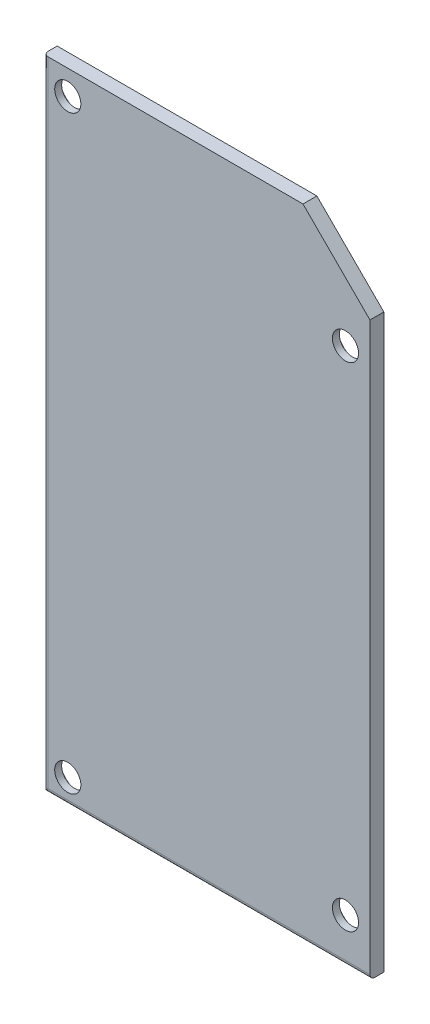
ISO-10303-21;
HEADER;
FILE_DESCRIPTION(('STEP AP214'),'2;1');
FILE_NAME('part.step','',(''),(''),'','','');
FILE_SCHEMA(('AUTOMOTIVE_DESIGN { 1 0 10303 214 1 1 1 1 }'));
ENDSEC;
DATA;
#1=APPLICATION_CONTEXT('core data for automotive mechanical design processes');
#2=APPLICATION_PROTOCOL_DEFINITION('international standard','automotive_design',2000,#1);
#3=PRODUCT_CONTEXT('',#1,'mechanical');
#4=PRODUCT('Part','Part','',(#3));
#5=PRODUCT_RELATED_PRODUCT_CATEGORY('part','',(#4));
#6=PRODUCT_DEFINITION_FORMATION('','',#4);
#7=PRODUCT_DEFINITION_CONTEXT('part definition',#1,'design');
#8=PRODUCT_DEFINITION('design','',#6,#7);
#9=PRODUCT_DEFINITION_SHAPE('','',#8);
#10=(LENGTH_UNIT() NAMED_UNIT(*) SI_UNIT(.MILLI.,.METRE.));
#11=(NAMED_UNIT(*) PLANE_ANGLE_UNIT() SI_UNIT($,.RADIAN.));
#12=(NAMED_UNIT(*) SI_UNIT($,.STERADIAN.) SOLID_ANGLE_UNIT());
#13=UNCERTAINTY_MEASURE_WITH_UNIT(LENGTH_MEASURE(1.E-05),#10,'distance_accuracy_value','');
#14=(GEOMETRIC_REPRESENTATION_CONTEXT(3) GLOBAL_UNCERTAINTY_ASSIGNED_CONTEXT((#13)) GLOBAL_UNIT_ASSIGNED_CONTEXT((#10,
#11,#12)) REPRESENTATION_CONTEXT('',''));
#15=CARTESIAN_POINT('',(0.,0.,0.));
#16=DIRECTION('',(0.,0.,1.));
#17=DIRECTION('',(1.,0.,0.));
#18=AXIS2_PLACEMENT_3D('',#15,#16,#17);
#19=CARTESIAN_POINT('',(0.,0.,28.));
#20=DIRECTION('',(0.,0.,-1.));
#21=DIRECTION('',(-1.,0.,0.));
#22=AXIS2_PLACEMENT_3D('',#19,#20,#21);
#23=PLANE('',#22);
#24=CARTESIAN_POINT('',(3.,3.,28.));
#25=DIRECTION('',(0.,0.,1.));
#26=DIRECTION('',(1.,0.,0.));
#27=AXIS2_PLACEMENT_3D('',#24,#25,#26);
#28=CIRCLE('',#27,2.75);
#29=CARTESIAN_POINT('',(5.75,3.,28.));
#30=VERTEX_POINT('',#29);
#31=EDGE_CURVE('E169',#30,#30,#28,.T.);
#32=ORIENTED_EDGE('',*,*,#31,.T.);
#33=EDGE_LOOP('',(#32));
#34=FACE_BOUND('',#33,.T.);
#35=CARTESIAN_POINT('',(3.,75.2,28.));
#36=DIRECTION('',(0.,0.,1.));
#37=DIRECTION('',(1.,0.,0.));
#38=AXIS2_PLACEMENT_3D('',#35,#36,#37);
#39=CIRCLE('',#38,2.75);
#40=CARTESIAN_POINT('',(5.75,75.2,28.));
#41=VERTEX_POINT('',#40);
#42=EDGE_CURVE('E124',#41,#41,#39,.T.);
#43=ORIENTED_EDGE('',*,*,#42,.T.);
#44=EDGE_LOOP('',(#43));
#45=FACE_BOUND('',#44,.T.);
#46=DIRECTION('',(-1.,0.,0.));
#47=VECTOR('',#46,1.);
#48=CARTESIAN_POINT('',(0.,0.,28.));
#49=LINE('',#48,#47);
#50=CARTESIAN_POINT('',(40.,0.,28.));
#51=VERTEX_POINT('',#50);
#52=CARTESIAN_POINT('',(0.,0.,28.));
#53=VERTEX_POINT('',#52);
#54=EDGE_CURVE('E108',#51,#53,#49,.T.);
#55=ORIENTED_EDGE('',*,*,#54,.T.);
#56=DIRECTION('',(0.,-1.,0.));
#57=VECTOR('',#56,1.);
#58=CARTESIAN_POINT('',(0.,0.,28.));
#59=LINE('',#58,#57);
#60=CARTESIAN_POINT('',(0.,78.2,28.));
#61=VERTEX_POINT('',#60);
#62=EDGE_CURVE('E94',#61,#53,#59,.T.);
#63=ORIENTED_EDGE('',*,*,#62,.F.);
#64=DIRECTION('',(1.,0.,0.));
#65=VECTOR('',#64,1.);
#66=CARTESIAN_POINT('',(0.,78.2,28.));
#67=LINE('',#66,#65);
#68=CARTESIAN_POINT('',(31.8000000000001,78.2,28.));
#69=VERTEX_POINT('',#68);
#70=EDGE_CURVE('E104',#61,#69,#67,.T.);
#71=ORIENTED_EDGE('',*,*,#70,.T.);
#72=DIRECTION('',(0.707106781186544,-0.707106781186551,0.));
#73=VECTOR('',#72,1.);
#74=CARTESIAN_POINT('',(31.8000000000001,78.2,28.));
#75=LINE('',#74,#73);
#76=CARTESIAN_POINT('',(40.,70.,28.));
#77=VERTEX_POINT('',#76);
#78=EDGE_CURVE('E115',#69,#77,#75,.T.);
#79=ORIENTED_EDGE('',*,*,#78,.T.);
#80=DIRECTION('',(0.,-1.,0.));
#81=VECTOR('',#80,1.);
#82=CARTESIAN_POINT('',(40.,0.,28.));
#83=LINE('',#82,#81);
#84=EDGE_CURVE('E118',#77,#51,#83,.T.);
#85=ORIENTED_EDGE('',*,*,#84,.T.);
#86=EDGE_LOOP('',(#55,#63,#71,#79,#85));
#87=FACE_BOUND('',#86,.T.);
#88=CARTESIAN_POINT('',(37.,65.7573593128807,28.));
#89=DIRECTION('',(0.,0.,1.));
#90=DIRECTION('',(1.,0.,0.));
#91=AXIS2_PLACEMENT_3D('',#88,#89,#90);
#92=CIRCLE('',#91,2.75);
#93=CARTESIAN_POINT('',(39.75,65.7573593128807,28.));
#94=VERTEX_POINT('',#93);
#95=EDGE_CURVE('E164',#94,#94,#92,.T.);
#96=ORIENTED_EDGE('',*,*,#95,.T.);
#97=EDGE_LOOP('',(#96));
#98=FACE_BOUND('',#97,.T.);
#99=CARTESIAN_POINT('',(37.,5.39999999999994,28.));
#100=DIRECTION('',(0.,0.,1.));
#101=DIRECTION('',(1.,0.,0.));
#102=AXIS2_PLACEMENT_3D('',#99,#100,#101);
#103=CIRCLE('',#102,2.75);
#104=CARTESIAN_POINT('',(39.75,5.39999999999994,28.));
#105=VERTEX_POINT('',#104);
#106=EDGE_CURVE('E191',#105,#105,#103,.T.);
#107=ORIENTED_EDGE('',*,*,#106,.T.);
#108=EDGE_LOOP('',(#107));
#109=FACE_BOUND('',#108,.T.);
#110=ADVANCED_FACE('F37',(#34,#45,#87,#98,#109),#23,.T.);
#111=CARTESIAN_POINT('',(0.,0.,28.));
#112=DIRECTION('',(0.,1.,0.));
#113=DIRECTION('',(0.,0.,1.));
#114=AXIS2_PLACEMENT_3D('',#111,#112,#113);
#115=PLANE('',#114);
#116=DIRECTION('',(0.,0.,-1.));
#117=VECTOR('',#116,1.);
#118=CARTESIAN_POINT('',(40.,0.,28.));
#119=LINE('',#118,#117);
#120=CARTESIAN_POINT('',(40.,0.,29.1));
#121=VERTEX_POINT('',#120);
#122=EDGE_CURVE('E152',#121,#51,#119,.T.);
#123=ORIENTED_EDGE('',*,*,#122,.F.);
#124=DIRECTION('',(1.,0.,0.));
#125=VECTOR('',#124,1.);
#126=CARTESIAN_POINT('',(0.,0.,29.1));
#127=LINE('',#126,#125);
#128=CARTESIAN_POINT('',(0.,0.,29.1));
#129=VERTEX_POINT('',#128);
#130=EDGE_CURVE('E60',#121,#129,#127,.F.);
#131=ORIENTED_EDGE('',*,*,#130,.T.);
#132=DIRECTION('',(0.,0.,-1.));
#133=VECTOR('',#132,1.);
#134=CARTESIAN_POINT('',(0.,0.,28.));
#135=LINE('',#134,#133);
#136=EDGE_CURVE('E154',#129,#53,#135,.T.);
#137=ORIENTED_EDGE('',*,*,#136,.T.);
#138=ORIENTED_EDGE('',*,*,#54,.F.);
#139=EDGE_LOOP('',(#123,#131,#137,#138));
#140=FACE_BOUND('',#139,.T.);
#141=ADVANCED_FACE('F185',(#140),#115,.F.);
#142=CARTESIAN_POINT('',(40.,0.,28.));
#143=DIRECTION('',(-1.,0.,0.));
#144=DIRECTION('',(0.,0.,1.));
#145=AXIS2_PLACEMENT_3D('',#142,#143,#144);
#146=PLANE('',#145);
#147=DIRECTION('',(0.,1.,0.));
#148=VECTOR('',#147,1.);
#149=CARTESIAN_POINT('',(40.,70.,29.7));
#150=LINE('',#149,#148);
#151=CARTESIAN_POINT('',(40.,0.600000000000003,29.7));
#152=VERTEX_POINT('',#151);
#153=CARTESIAN_POINT('',(40.,70.,29.7));
#154=VERTEX_POINT('',#153);
#155=EDGE_CURVE('E109',#152,#154,#150,.T.);
#156=ORIENTED_EDGE('',*,*,#155,.F.);
#157=CARTESIAN_POINT('',(40.,0.6,29.1));
#158=DIRECTION('',(-1.,0.,0.));
#159=DIRECTION('',(0.,0.,1.));
#160=AXIS2_PLACEMENT_3D('',#157,#158,#159);
#161=CIRCLE('',#160,0.6);
#162=EDGE_CURVE('E175',#152,#121,#161,.F.);
#163=ORIENTED_EDGE('',*,*,#162,.T.);
#164=ORIENTED_EDGE('',*,*,#122,.T.);
#165=ORIENTED_EDGE('',*,*,#84,.F.);
#166=DIRECTION('',(0.,0.,-1.));
#167=VECTOR('',#166,1.);
#168=CARTESIAN_POINT('',(40.,70.,28.));
#169=LINE('',#168,#167);
#170=EDGE_CURVE('E149',#154,#77,#169,.T.);
#171=ORIENTED_EDGE('',*,*,#170,.F.);
#172=EDGE_LOOP('',(#156,#163,#164,#165,#171));
#173=FACE_BOUND('',#172,.T.);
#174=ADVANCED_FACE('F180',(#173),#146,.F.);
#175=CARTESIAN_POINT('',(31.8000000000001,78.2,28.));
#176=DIRECTION('',(-0.707106781186551,-0.707106781186544,0.));
#177=DIRECTION('',(0.707106781186544,-0.707106781186551,0.));
#178=AXIS2_PLACEMENT_3D('',#175,#176,#177);
#179=PLANE('',#178);
#180=ORIENTED_EDGE('',*,*,#78,.F.);
#181=DIRECTION('',(0.,0.,-1.));
#182=VECTOR('',#181,1.);
#183=CARTESIAN_POINT('',(31.8000000000001,78.2,28.));
#184=LINE('',#183,#182);
#185=CARTESIAN_POINT('',(31.8000000000001,78.2,29.7));
#186=VERTEX_POINT('',#185);
#187=EDGE_CURVE('E99',#186,#69,#184,.T.);
#188=ORIENTED_EDGE('',*,*,#187,.F.);
#189=DIRECTION('',(-0.707106781186544,0.707106781186551,0.));
#190=VECTOR('',#189,1.);
#191=CARTESIAN_POINT('',(31.8000000000001,78.2,29.7));
#192=LINE('',#191,#190);
#193=EDGE_CURVE('E141',#154,#186,#192,.T.);
#194=ORIENTED_EDGE('',*,*,#193,.F.);
#195=ORIENTED_EDGE('',*,*,#170,.T.);
#196=EDGE_LOOP('',(#180,#188,#194,#195));
#197=FACE_BOUND('',#196,.T.);
#198=ADVANCED_FACE('F243',(#197),#179,.F.);
#199=CARTESIAN_POINT('',(0.,78.2,28.));
#200=DIRECTION('',(0.,-1.,0.));
#201=DIRECTION('',(0.,0.,-1.));
#202=AXIS2_PLACEMENT_3D('',#199,#200,#201);
#203=PLANE('',#202);
#204=DIRECTION('',(0.,0.,-1.));
#205=VECTOR('',#204,1.);
#206=CARTESIAN_POINT('',(0.,78.2,28.));
#207=LINE('',#206,#205);
#208=CARTESIAN_POINT('',(0.,78.2,29.1));
#209=VERTEX_POINT('',#208);
#210=EDGE_CURVE('E91',#209,#61,#207,.T.);
#211=ORIENTED_EDGE('',*,*,#210,.F.);
#212=CARTESIAN_POINT('',(0.6,78.2,29.1));
#213=DIRECTION('',(0.,-1.,0.));
#214=DIRECTION('',(0.,0.,-1.));
#215=AXIS2_PLACEMENT_3D('',#212,#213,#214);
#216=CIRCLE('',#215,0.6);
#217=CARTESIAN_POINT('',(0.6,78.2,29.7));
#218=VERTEX_POINT('',#217);
#219=EDGE_CURVE('E11',#209,#218,#216,.F.);
#220=ORIENTED_EDGE('',*,*,#219,.T.);
#221=DIRECTION('',(-1.,0.,0.));
#222=VECTOR('',#221,1.);
#223=CARTESIAN_POINT('',(0.,78.2,29.7));
#224=LINE('',#223,#222);
#225=EDGE_CURVE('E100',#186,#218,#224,.T.);
#226=ORIENTED_EDGE('',*,*,#225,.F.);
#227=ORIENTED_EDGE('',*,*,#187,.T.);
#228=ORIENTED_EDGE('',*,*,#70,.F.);
#229=EDGE_LOOP('',(#211,#220,#226,#227,#228));
#230=FACE_BOUND('',#229,.T.);
#231=ADVANCED_FACE('F113',(#230),#203,.F.);
#232=CARTESIAN_POINT('',(0.,78.2,28.));
#233=DIRECTION('',(1.,0.,0.));
#234=DIRECTION('',(0.,0.,-1.));
#235=AXIS2_PLACEMENT_3D('',#232,#233,#234);
#236=PLANE('',#235);
#237=ORIENTED_EDGE('',*,*,#136,.F.);
#238=DIRECTION('',(0.,-1.,0.));
#239=VECTOR('',#238,1.);
#240=CARTESIAN_POINT('',(0.,78.2,29.1));
#241=LINE('',#240,#239);
#242=EDGE_CURVE('E46',#129,#209,#241,.F.);
#243=ORIENTED_EDGE('',*,*,#242,.T.);
#244=ORIENTED_EDGE('',*,*,#210,.T.);
#245=ORIENTED_EDGE('',*,*,#62,.T.);
#246=EDGE_LOOP('',(#237,#243,#244,#245));
#247=FACE_BOUND('',#246,.T.);
#248=ADVANCED_FACE('F93',(#247),#236,.F.);
#249=CARTESIAN_POINT('',(0.,0.,29.7));
#250=DIRECTION('',(0.,0.,-1.));
#251=DIRECTION('',(-1.,0.,0.));
#252=AXIS2_PLACEMENT_3D('',#249,#250,#251);
#253=PLANE('',#252);
#254=CARTESIAN_POINT('',(37.,5.39999999999994,29.7));
#255=DIRECTION('',(0.,0.,1.));
#256=DIRECTION('',(1.,0.,0.));
#257=AXIS2_PLACEMENT_3D('',#254,#255,#256);
#258=CIRCLE('',#257,1.6);
#259=CARTESIAN_POINT('',(38.6,5.39999999999994,29.7));
#260=VERTEX_POINT('',#259);
#261=EDGE_CURVE('E132',#260,#260,#258,.T.);
#262=ORIENTED_EDGE('',*,*,#261,.F.);
#263=EDGE_LOOP('',(#262));
#264=FACE_BOUND('',#263,.T.);
#265=CARTESIAN_POINT('',(3.,75.2,29.7));
#266=DIRECTION('',(0.,0.,1.));
#267=DIRECTION('',(1.,0.,0.));
#268=AXIS2_PLACEMENT_3D('',#265,#266,#267);
#269=CIRCLE('',#268,1.6);
#270=CARTESIAN_POINT('',(4.6,75.2,29.7));
#271=VERTEX_POINT('',#270);
#272=EDGE_CURVE('E110',#271,#271,#269,.T.);
#273=ORIENTED_EDGE('',*,*,#272,.F.);
#274=EDGE_LOOP('',(#273));
#275=FACE_BOUND('',#274,.T.);
#276=DIRECTION('',(0.,-1.,0.));
#277=VECTOR('',#276,1.);
#278=CARTESIAN_POINT('',(0.6,0.,29.7));
#279=LINE('',#278,#277);
#280=CARTESIAN_POINT('',(0.6,0.6,29.7));
#281=VERTEX_POINT('',#280);
#282=EDGE_CURVE('E155',#218,#281,#279,.T.);
#283=ORIENTED_EDGE('',*,*,#282,.T.);
#284=DIRECTION('',(1.,0.,0.));
#285=VECTOR('',#284,1.);
#286=CARTESIAN_POINT('',(0.,0.6,29.7));
#287=LINE('',#286,#285);
#288=EDGE_CURVE('E172',#281,#152,#287,.T.);
#289=ORIENTED_EDGE('',*,*,#288,.T.);
#290=ORIENTED_EDGE('',*,*,#155,.T.);
#291=ORIENTED_EDGE('',*,*,#193,.T.);
#292=ORIENTED_EDGE('',*,*,#225,.T.);
#293=EDGE_LOOP('',(#283,#289,#290,#291,#292));
#294=FACE_BOUND('',#293,.T.);
#295=CARTESIAN_POINT('',(37.,65.7573593128807,29.7));
#296=DIRECTION('',(0.,0.,1.));
#297=DIRECTION('',(1.,0.,0.));
#298=AXIS2_PLACEMENT_3D('',#295,#296,#297);
#299=CIRCLE('',#298,1.6);
#300=CARTESIAN_POINT('',(38.6,65.7573593128807,29.7));
#301=VERTEX_POINT('',#300);
#302=EDGE_CURVE('E135',#301,#301,#299,.T.);
#303=ORIENTED_EDGE('',*,*,#302,.F.);
#304=EDGE_LOOP('',(#303));
#305=FACE_BOUND('',#304,.T.);
#306=CARTESIAN_POINT('',(3.,3.,29.7));
#307=DIRECTION('',(0.,0.,1.));
#308=DIRECTION('',(1.,0.,0.));
#309=AXIS2_PLACEMENT_3D('',#306,#307,#308);
#310=CIRCLE('',#309,1.6);
#311=CARTESIAN_POINT('',(4.6,3.,29.7));
#312=VERTEX_POINT('',#311);
#313=EDGE_CURVE('E129',#312,#312,#310,.T.);
#314=ORIENTED_EDGE('',*,*,#313,.F.);
#315=EDGE_LOOP('',(#314));
#316=FACE_BOUND('',#315,.T.);
#317=ADVANCED_FACE('F237',(#264,#275,#294,#305,#316),#253,.F.);
#318=CARTESIAN_POINT('',(3.,75.2,29.7));
#319=DIRECTION('',(0.,0.,-1.));
#320=DIRECTION('',(-1.,0.,0.));
#321=AXIS2_PLACEMENT_3D('',#318,#319,#320);
#322=CYLINDRICAL_SURFACE('',#321,1.6);
#323=CARTESIAN_POINT('',(3.,75.2,28.85));
#324=DIRECTION('',(0.,0.,1.));
#325=DIRECTION('',(1.,0.,0.));
#326=AXIS2_PLACEMENT_3D('',#323,#324,#325);
#327=CIRCLE('',#326,1.6);
#328=CARTESIAN_POINT('',(4.6,75.2,28.85));
#329=VERTEX_POINT('',#328);
#330=EDGE_CURVE('E116',#329,#329,#327,.T.);
#331=ORIENTED_EDGE('',*,*,#330,.F.);
#332=EDGE_LOOP('',(#331));
#333=FACE_BOUND('',#332,.T.);
#334=ORIENTED_EDGE('',*,*,#272,.T.);
#335=EDGE_LOOP('',(#334));
#336=FACE_BOUND('',#335,.T.);
#337=ADVANCED_FACE('F263',(#333,#336),#322,.F.);
#338=CARTESIAN_POINT('',(37.,65.7573593128807,29.7));
#339=DIRECTION('',(0.,0.,-1.));
#340=DIRECTION('',(-1.,0.,0.));
#341=AXIS2_PLACEMENT_3D('',#338,#339,#340);
#342=CYLINDRICAL_SURFACE('',#341,1.6);
#343=CARTESIAN_POINT('',(37.,65.7573593128807,28.85));
#344=DIRECTION('',(0.,0.,1.));
#345=DIRECTION('',(1.,0.,0.));
#346=AXIS2_PLACEMENT_3D('',#343,#344,#345);
#347=CIRCLE('',#346,1.6);
#348=CARTESIAN_POINT('',(38.6,65.7573593128807,28.85));
#349=VERTEX_POINT('',#348);
#350=EDGE_CURVE('E157',#349,#349,#347,.T.);
#351=ORIENTED_EDGE('',*,*,#350,.F.);
#352=EDGE_LOOP('',(#351));
#353=FACE_BOUND('',#352,.T.);
#354=ORIENTED_EDGE('',*,*,#302,.T.);
#355=EDGE_LOOP('',(#354));
#356=FACE_BOUND('',#355,.T.);
#357=ADVANCED_FACE('F270',(#353,#356),#342,.F.);
#358=CARTESIAN_POINT('',(37.,5.39999999999994,29.7));
#359=DIRECTION('',(0.,0.,-1.));
#360=DIRECTION('',(-1.,0.,0.));
#361=AXIS2_PLACEMENT_3D('',#358,#359,#360);
#362=CYLINDRICAL_SURFACE('',#361,1.6);
#363=CARTESIAN_POINT('',(37.,5.39999999999994,28.85));
#364=DIRECTION('',(0.,0.,1.));
#365=DIRECTION('',(1.,0.,0.));
#366=AXIS2_PLACEMENT_3D('',#363,#364,#365);
#367=CIRCLE('',#366,1.6);
#368=CARTESIAN_POINT('',(38.6,5.39999999999994,28.85));
#369=VERTEX_POINT('',#368);
#370=EDGE_CURVE('E166',#369,#369,#367,.T.);
#371=ORIENTED_EDGE('',*,*,#370,.F.);
#372=EDGE_LOOP('',(#371));
#373=FACE_BOUND('',#372,.T.);
#374=ORIENTED_EDGE('',*,*,#261,.T.);
#375=EDGE_LOOP('',(#374));
#376=FACE_BOUND('',#375,.T.);
#377=ADVANCED_FACE('F225',(#373,#376),#362,.F.);
#378=CARTESIAN_POINT('',(3.,3.,29.7));
#379=DIRECTION('',(0.,0.,-1.));
#380=DIRECTION('',(-1.,0.,0.));
#381=AXIS2_PLACEMENT_3D('',#378,#379,#380);
#382=CYLINDRICAL_SURFACE('',#381,1.6);
#383=CARTESIAN_POINT('',(3.,3.,28.85));
#384=DIRECTION('',(0.,0.,1.));
#385=DIRECTION('',(1.,0.,0.));
#386=AXIS2_PLACEMENT_3D('',#383,#384,#385);
#387=CIRCLE('',#386,1.6);
#388=CARTESIAN_POINT('',(4.6,3.,28.85));
#389=VERTEX_POINT('',#388);
#390=EDGE_CURVE('E161',#389,#389,#387,.T.);
#391=ORIENTED_EDGE('',*,*,#390,.F.);
#392=EDGE_LOOP('',(#391));
#393=FACE_BOUND('',#392,.T.);
#394=ORIENTED_EDGE('',*,*,#313,.T.);
#395=EDGE_LOOP('',(#394));
#396=FACE_BOUND('',#395,.T.);
#397=ADVANCED_FACE('F216',(#393,#396),#382,.F.);
#398=CARTESIAN_POINT('',(3.,75.2,28.85));
#399=DIRECTION('',(0.,0.,-1.));
#400=DIRECTION('',(-1.,0.,0.));
#401=AXIS2_PLACEMENT_3D('',#398,#399,#400);
#402=CYLINDRICAL_SURFACE('',#401,2.75);
#403=CARTESIAN_POINT('',(3.,75.2,28.85));
#404=DIRECTION('',(0.,0.,1.));
#405=DIRECTION('',(1.,0.,0.));
#406=AXIS2_PLACEMENT_3D('',#403,#404,#405);
#407=CIRCLE('',#406,2.75);
#408=CARTESIAN_POINT('',(5.75,75.2,28.85));
#409=VERTEX_POINT('',#408);
#410=EDGE_CURVE('E121',#409,#409,#407,.T.);
#411=ORIENTED_EDGE('',*,*,#410,.T.);
#412=EDGE_LOOP('',(#411));
#413=FACE_BOUND('',#412,.T.);
#414=ORIENTED_EDGE('',*,*,#42,.F.);
#415=EDGE_LOOP('',(#414));
#416=FACE_BOUND('',#415,.T.);
#417=ADVANCED_FACE('F213',(#413,#416),#402,.F.);
#418=CARTESIAN_POINT('',(3.,75.2,28.85));
#419=DIRECTION('',(0.,0.,1.));
#420=DIRECTION('',(1.,0.,0.));
#421=AXIS2_PLACEMENT_3D('',#418,#419,#420);
#422=PLANE('',#421);
#423=ORIENTED_EDGE('',*,*,#330,.T.);
#424=EDGE_LOOP('',(#423));
#425=FACE_BOUND('',#424,.T.);
#426=ORIENTED_EDGE('',*,*,#410,.F.);
#427=EDGE_LOOP('',(#426));
#428=FACE_BOUND('',#427,.T.);
#429=ADVANCED_FACE('F215',(#425,#428),#422,.F.);
#430=CARTESIAN_POINT('',(37.,65.7573593128807,28.85));
#431=DIRECTION('',(0.,0.,-1.));
#432=DIRECTION('',(-1.,0.,0.));
#433=AXIS2_PLACEMENT_3D('',#430,#431,#432);
#434=CYLINDRICAL_SURFACE('',#433,2.75);
#435=CARTESIAN_POINT('',(37.,65.7573593128807,28.85));
#436=DIRECTION('',(0.,0.,1.));
#437=DIRECTION('',(1.,0.,0.));
#438=AXIS2_PLACEMENT_3D('',#435,#436,#437);
#439=CIRCLE('',#438,2.75);
#440=CARTESIAN_POINT('',(39.75,65.7573593128807,28.85));
#441=VERTEX_POINT('',#440);
#442=EDGE_CURVE('E160',#441,#441,#439,.T.);
#443=ORIENTED_EDGE('',*,*,#442,.T.);
#444=EDGE_LOOP('',(#443));
#445=FACE_BOUND('',#444,.T.);
#446=ORIENTED_EDGE('',*,*,#95,.F.);
#447=EDGE_LOOP('',(#446));
#448=FACE_BOUND('',#447,.T.);
#449=ADVANCED_FACE('F222',(#445,#448),#434,.F.);
#450=CARTESIAN_POINT('',(37.,65.7573593128807,28.85));
#451=DIRECTION('',(0.,0.,1.));
#452=DIRECTION('',(1.,0.,0.));
#453=AXIS2_PLACEMENT_3D('',#450,#451,#452);
#454=PLANE('',#453);
#455=ORIENTED_EDGE('',*,*,#350,.T.);
#456=EDGE_LOOP('',(#455));
#457=FACE_BOUND('',#456,.T.);
#458=ORIENTED_EDGE('',*,*,#442,.F.);
#459=EDGE_LOOP('',(#458));
#460=FACE_BOUND('',#459,.T.);
#461=ADVANCED_FACE('F283',(#457,#460),#454,.F.);
#462=CARTESIAN_POINT('',(3.,3.,28.85));
#463=DIRECTION('',(0.,0.,-1.));
#464=DIRECTION('',(-1.,0.,0.));
#465=AXIS2_PLACEMENT_3D('',#462,#463,#464);
#466=CYLINDRICAL_SURFACE('',#465,2.75);
#467=CARTESIAN_POINT('',(3.,3.,28.85));
#468=DIRECTION('',(0.,0.,1.));
#469=DIRECTION('',(1.,0.,0.));
#470=AXIS2_PLACEMENT_3D('',#467,#468,#469);
#471=CIRCLE('',#470,2.75);
#472=CARTESIAN_POINT('',(5.75,3.,28.85));
#473=VERTEX_POINT('',#472);
#474=EDGE_CURVE('E165',#473,#473,#471,.T.);
#475=ORIENTED_EDGE('',*,*,#474,.T.);
#476=EDGE_LOOP('',(#475));
#477=FACE_BOUND('',#476,.T.);
#478=ORIENTED_EDGE('',*,*,#31,.F.);
#479=EDGE_LOOP('',(#478));
#480=FACE_BOUND('',#479,.T.);
#481=ADVANCED_FACE('F286',(#477,#480),#466,.F.);
#482=CARTESIAN_POINT('',(3.,3.,28.85));
#483=DIRECTION('',(0.,0.,1.));
#484=DIRECTION('',(1.,0.,0.));
#485=AXIS2_PLACEMENT_3D('',#482,#483,#484);
#486=PLANE('',#485);
#487=ORIENTED_EDGE('',*,*,#390,.T.);
#488=EDGE_LOOP('',(#487));
#489=FACE_BOUND('',#488,.T.);
#490=ORIENTED_EDGE('',*,*,#474,.F.);
#491=EDGE_LOOP('',(#490));
#492=FACE_BOUND('',#491,.T.);
#493=ADVANCED_FACE('F299',(#489,#492),#486,.F.);
#494=CARTESIAN_POINT('',(37.,5.39999999999994,28.85));
#495=DIRECTION('',(0.,0.,-1.));
#496=DIRECTION('',(-1.,0.,0.));
#497=AXIS2_PLACEMENT_3D('',#494,#495,#496);
#498=CYLINDRICAL_SURFACE('',#497,2.75);
#499=CARTESIAN_POINT('',(37.,5.39999999999994,28.85));
#500=DIRECTION('',(0.,0.,1.));
#501=DIRECTION('',(1.,0.,0.));
#502=AXIS2_PLACEMENT_3D('',#499,#500,#501);
#503=CIRCLE('',#502,2.75);
#504=CARTESIAN_POINT('',(39.75,5.39999999999994,28.85));
#505=VERTEX_POINT('',#504);
#506=EDGE_CURVE('E170',#505,#505,#503,.T.);
#507=ORIENTED_EDGE('',*,*,#506,.T.);
#508=EDGE_LOOP('',(#507));
#509=FACE_BOUND('',#508,.T.);
#510=ORIENTED_EDGE('',*,*,#106,.F.);
#511=EDGE_LOOP('',(#510));
#512=FACE_BOUND('',#511,.T.);
#513=ADVANCED_FACE('F256',(#509,#512),#498,.F.);
#514=CARTESIAN_POINT('',(37.,5.39999999999994,28.85));
#515=DIRECTION('',(0.,0.,1.));
#516=DIRECTION('',(1.,0.,0.));
#517=AXIS2_PLACEMENT_3D('',#514,#515,#516);
#518=PLANE('',#517);
#519=ORIENTED_EDGE('',*,*,#370,.T.);
#520=EDGE_LOOP('',(#519));
#521=FACE_BOUND('',#520,.T.);
#522=ORIENTED_EDGE('',*,*,#506,.F.);
#523=EDGE_LOOP('',(#522));
#524=FACE_BOUND('',#523,.T.);
#525=ADVANCED_FACE('F252',(#521,#524),#518,.F.);
#526=CARTESIAN_POINT('',(0.6,0.,29.1));
#527=DIRECTION('',(0.,-1.,0.));
#528=DIRECTION('',(0.,0.,-1.));
#529=AXIS2_PLACEMENT_3D('',#526,#527,#528);
#530=CYLINDRICAL_SURFACE('',#529,0.6);
#531=ORIENTED_EDGE('',*,*,#219,.F.);
#532=ORIENTED_EDGE('',*,*,#242,.F.);
#533=CARTESIAN_POINT('',(0.6,0.6,29.1));
#534=DIRECTION('',(0.707106781186547,-0.707106781186547,0.));
#535=DIRECTION('',(-0.707106781186547,-0.707106781186547,0.));
#536=AXIS2_PLACEMENT_3D('',#533,#534,#535);
#537=ELLIPSE('',#536,0.848528137423857,0.6);
#538=EDGE_CURVE('E41',#281,#129,#537,.T.);
#539=ORIENTED_EDGE('',*,*,#538,.F.);
#540=ORIENTED_EDGE('',*,*,#282,.F.);
#541=EDGE_LOOP('',(#531,#532,#539,#540));
#542=FACE_BOUND('',#541,.T.);
#543=ADVANCED_FACE('F39',(#542),#530,.T.);
#544=CARTESIAN_POINT('',(0.,0.6,29.1));
#545=DIRECTION('',(1.,0.,0.));
#546=DIRECTION('',(0.,0.,-1.));
#547=AXIS2_PLACEMENT_3D('',#544,#545,#546);
#548=CYLINDRICAL_SURFACE('',#547,0.6);
#549=ORIENTED_EDGE('',*,*,#538,.T.);
#550=ORIENTED_EDGE('',*,*,#130,.F.);
#551=ORIENTED_EDGE('',*,*,#162,.F.);
#552=ORIENTED_EDGE('',*,*,#288,.F.);
#553=EDGE_LOOP('',(#549,#550,#551,#552));
#554=FACE_BOUND('',#553,.T.);
#555=ADVANCED_FACE('F187',(#554),#548,.T.);
#556=CLOSED_SHELL('',(#110,#141,#174,#198,#231,#248,#317,#337,#357,#377,#397,#417,#429,#449,
#461,#481,#493,#513,#525,#543,#555));
#557=MANIFOLD_SOLID_BREP('B2',#556);
#558=ADVANCED_BREP_SHAPE_REPRESENTATION('',(#18,#557),#14);
#559=SHAPE_DEFINITION_REPRESENTATION(#9,#558);
ENDSEC;
END-ISO-10303-21;
